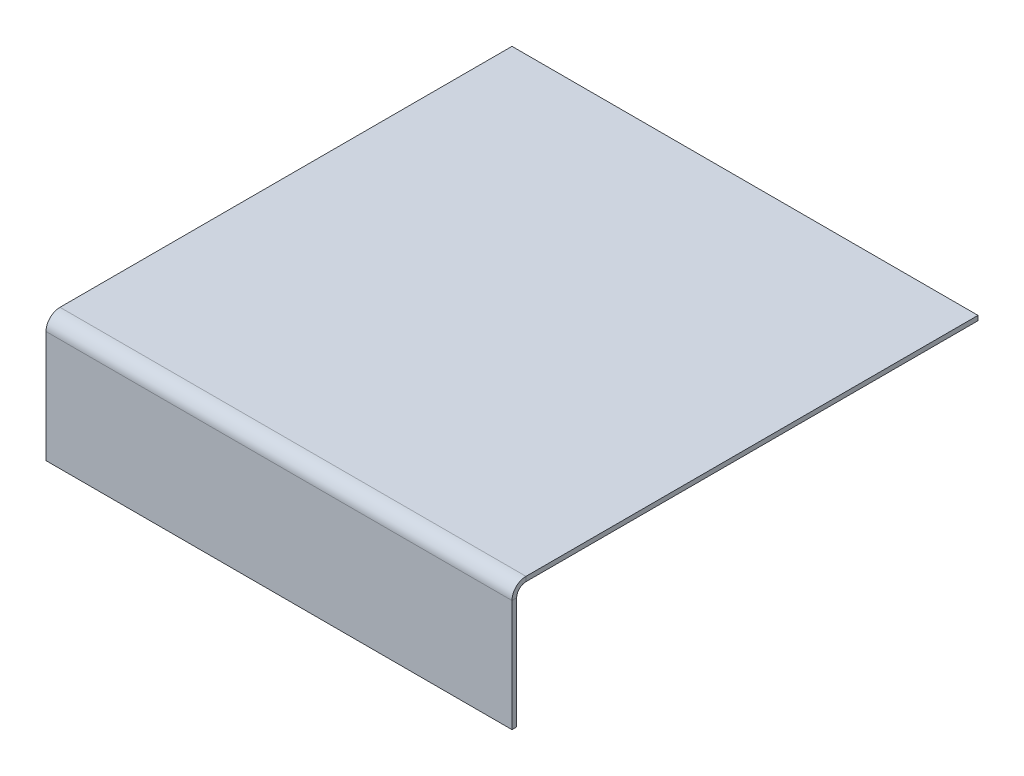
ISO-10303-21;
HEADER;
FILE_DESCRIPTION(('STEP AP214'),'2;1');
FILE_NAME('part.step','',(''),(''),'','','');
FILE_SCHEMA(('AUTOMOTIVE_DESIGN { 1 0 10303 214 1 1 1 1 }'));
ENDSEC;
DATA;
#1=APPLICATION_CONTEXT('core data for automotive mechanical design processes');
#2=APPLICATION_PROTOCOL_DEFINITION('international standard','automotive_design',2000,#1);
#3=PRODUCT_CONTEXT('',#1,'mechanical');
#4=PRODUCT('Part','Part','',(#3));
#5=PRODUCT_RELATED_PRODUCT_CATEGORY('part','',(#4));
#6=PRODUCT_DEFINITION_FORMATION('','',#4);
#7=PRODUCT_DEFINITION_CONTEXT('part definition',#1,'design');
#8=PRODUCT_DEFINITION('design','',#6,#7);
#9=PRODUCT_DEFINITION_SHAPE('','',#8);
#10=(LENGTH_UNIT() NAMED_UNIT(*) SI_UNIT(.MILLI.,.METRE.));
#11=(NAMED_UNIT(*) PLANE_ANGLE_UNIT() SI_UNIT($,.RADIAN.));
#12=(NAMED_UNIT(*) SI_UNIT($,.STERADIAN.) SOLID_ANGLE_UNIT());
#13=UNCERTAINTY_MEASURE_WITH_UNIT(LENGTH_MEASURE(1.E-05),#10,'distance_accuracy_value','');
#14=(GEOMETRIC_REPRESENTATION_CONTEXT(3) GLOBAL_UNCERTAINTY_ASSIGNED_CONTEXT((#13)) GLOBAL_UNIT_ASSIGNED_CONTEXT((#10,
#11,#12)) REPRESENTATION_CONTEXT('',''));
#15=CARTESIAN_POINT('',(0.,0.,0.));
#16=DIRECTION('',(0.,0.,1.));
#17=DIRECTION('',(1.,0.,0.));
#18=AXIS2_PLACEMENT_3D('',#15,#16,#17);
#19=CARTESIAN_POINT('',(-50.,-1.,50.));
#20=DIRECTION('',(-1.,0.,0.));
#21=DIRECTION('',(0.,0.,1.));
#22=AXIS2_PLACEMENT_3D('',#19,#20,#21);
#23=PLANE('',#22);
#24=DIRECTION('',(0.,0.,1.));
#25=VECTOR('',#24,1.);
#26=CARTESIAN_POINT('',(-50.,-1.,50.));
#27=LINE('',#26,#25);
#28=CARTESIAN_POINT('',(-50.,-1.,-50.));
#29=VERTEX_POINT('',#28);
#30=CARTESIAN_POINT('',(-50.,-1.,47.));
#31=VERTEX_POINT('',#30);
#32=EDGE_CURVE('E196',#29,#31,#27,.T.);
#33=ORIENTED_EDGE('',*,*,#32,.T.);
#34=DIRECTION('',(0.,1.,0.));
#35=VECTOR('',#34,1.);
#36=CARTESIAN_POINT('',(-50.,-0.999999999999994,47.));
#37=LINE('',#36,#35);
#38=CARTESIAN_POINT('',(-50.,0.,47.));
#39=VERTEX_POINT('',#38);
#40=EDGE_CURVE('E181',#31,#39,#37,.T.);
#41=ORIENTED_EDGE('',*,*,#40,.T.);
#42=DIRECTION('',(0.,0.,1.));
#43=VECTOR('',#42,1.);
#44=CARTESIAN_POINT('',(-50.,0.,50.));
#45=LINE('',#44,#43);
#46=CARTESIAN_POINT('',(-50.,0.,-50.));
#47=VERTEX_POINT('',#46);
#48=EDGE_CURVE('E193',#47,#39,#45,.T.);
#49=ORIENTED_EDGE('',*,*,#48,.F.);
#50=DIRECTION('',(0.,1.,0.));
#51=VECTOR('',#50,1.);
#52=CARTESIAN_POINT('',(-50.,-1.,-50.));
#53=LINE('',#52,#51);
#54=EDGE_CURVE('E13',#29,#47,#53,.T.);
#55=ORIENTED_EDGE('',*,*,#54,.F.);
#56=EDGE_LOOP('',(#33,#41,#49,#55));
#57=FACE_BOUND('',#56,.T.);
#58=ADVANCED_FACE('F58',(#57),#23,.T.);
#59=CARTESIAN_POINT('',(0.,-1.,0.));
#60=DIRECTION('',(0.,-1.,0.));
#61=DIRECTION('',(0.,0.,-1.));
#62=AXIS2_PLACEMENT_3D('',#59,#60,#61);
#63=PLANE('',#62);
#64=DIRECTION('',(0.,0.,-1.));
#65=VECTOR('',#64,1.);
#66=CARTESIAN_POINT('',(50.,-1.,50.));
#67=LINE('',#66,#65);
#68=CARTESIAN_POINT('',(50.,-1.,47.));
#69=VERTEX_POINT('',#68);
#70=CARTESIAN_POINT('',(50.,-1.,-50.));
#71=VERTEX_POINT('',#70);
#72=EDGE_CURVE('E190',#69,#71,#67,.T.);
#73=ORIENTED_EDGE('',*,*,#72,.F.);
#74=DIRECTION('',(-1.,0.,0.));
#75=VECTOR('',#74,1.);
#76=CARTESIAN_POINT('',(-50.,-0.999999999999994,47.));
#77=LINE('',#76,#75);
#78=EDGE_CURVE('E73',#31,#69,#77,.F.);
#79=ORIENTED_EDGE('',*,*,#78,.F.);
#80=ORIENTED_EDGE('',*,*,#32,.F.);
#81=DIRECTION('',(-1.,0.,0.));
#82=VECTOR('',#81,1.);
#83=CARTESIAN_POINT('',(-50.,-1.,-50.));
#84=LINE('',#83,#82);
#85=EDGE_CURVE('E192',#71,#29,#84,.T.);
#86=ORIENTED_EDGE('',*,*,#85,.F.);
#87=EDGE_LOOP('',(#73,#79,#80,#86));
#88=FACE_BOUND('',#87,.T.);
#89=ADVANCED_FACE('F230',(#88),#63,.T.);
#90=CARTESIAN_POINT('',(0.,0.,0.));
#91=DIRECTION('',(0.,-1.,0.));
#92=DIRECTION('',(0.,0.,-1.));
#93=AXIS2_PLACEMENT_3D('',#90,#91,#92);
#94=PLANE('',#93);
#95=DIRECTION('',(-1.,0.,0.));
#96=VECTOR('',#95,1.);
#97=CARTESIAN_POINT('',(-50.,0.,47.));
#98=LINE('',#97,#96);
#99=CARTESIAN_POINT('',(50.,0.,47.));
#100=VERTEX_POINT('',#99);
#101=EDGE_CURVE('E131',#39,#100,#98,.F.);
#102=ORIENTED_EDGE('',*,*,#101,.T.);
#103=DIRECTION('',(0.,0.,-1.));
#104=VECTOR('',#103,1.);
#105=CARTESIAN_POINT('',(50.,0.,50.));
#106=LINE('',#105,#104);
#107=CARTESIAN_POINT('',(50.,0.,-50.));
#108=VERTEX_POINT('',#107);
#109=EDGE_CURVE('E188',#100,#108,#106,.T.);
#110=ORIENTED_EDGE('',*,*,#109,.T.);
#111=DIRECTION('',(-1.,0.,0.));
#112=VECTOR('',#111,1.);
#113=CARTESIAN_POINT('',(-50.,0.,-50.));
#114=LINE('',#113,#112);
#115=EDGE_CURVE('E199',#108,#47,#114,.T.);
#116=ORIENTED_EDGE('',*,*,#115,.T.);
#117=ORIENTED_EDGE('',*,*,#48,.T.);
#118=EDGE_LOOP('',(#102,#110,#116,#117));
#119=FACE_BOUND('',#118,.T.);
#120=ADVANCED_FACE('F205',(#119),#94,.F.);
#121=CARTESIAN_POINT('',(50.,-1.,50.));
#122=DIRECTION('',(1.,0.,0.));
#123=DIRECTION('',(0.,0.,-1.));
#124=AXIS2_PLACEMENT_3D('',#121,#122,#123);
#125=PLANE('',#124);
#126=DIRECTION('',(0.,1.,0.));
#127=VECTOR('',#126,1.);
#128=CARTESIAN_POINT('',(50.,-0.999999999999994,47.));
#129=LINE('',#128,#127);
#130=EDGE_CURVE('E81',#69,#100,#129,.T.);
#131=ORIENTED_EDGE('',*,*,#130,.F.);
#132=ORIENTED_EDGE('',*,*,#72,.T.);
#133=DIRECTION('',(0.,1.,0.));
#134=VECTOR('',#133,1.);
#135=CARTESIAN_POINT('',(50.,-1.,-50.));
#136=LINE('',#135,#134);
#137=EDGE_CURVE('E62',#71,#108,#136,.T.);
#138=ORIENTED_EDGE('',*,*,#137,.T.);
#139=ORIENTED_EDGE('',*,*,#109,.F.);
#140=EDGE_LOOP('',(#131,#132,#138,#139));
#141=FACE_BOUND('',#140,.T.);
#142=ADVANCED_FACE('F60',(#141),#125,.T.);
#143=CARTESIAN_POINT('',(-50.,-1.,-50.));
#144=DIRECTION('',(0.,0.,-1.));
#145=DIRECTION('',(-1.,0.,0.));
#146=AXIS2_PLACEMENT_3D('',#143,#144,#145);
#147=PLANE('',#146);
#148=ORIENTED_EDGE('',*,*,#115,.F.);
#149=ORIENTED_EDGE('',*,*,#137,.F.);
#150=ORIENTED_EDGE('',*,*,#85,.T.);
#151=ORIENTED_EDGE('',*,*,#54,.T.);
#152=EDGE_LOOP('',(#148,#149,#150,#151));
#153=FACE_BOUND('',#152,.T.);
#154=ADVANCED_FACE('F237',(#153),#147,.T.);
#155=CARTESIAN_POINT('',(50.,-3.,47.));
#156=DIRECTION('',(1.,0.,0.));
#157=DIRECTION('',(0.,0.,-1.));
#158=AXIS2_PLACEMENT_3D('',#155,#156,#157);
#159=PLANE('',#158);
#160=DIRECTION('',(0.,0.,1.));
#161=VECTOR('',#160,1.);
#162=CARTESIAN_POINT('',(50.,-3.,50.0000000000001));
#163=LINE('',#162,#161);
#164=CARTESIAN_POINT('',(50.,-2.99999999999999,49.));
#165=VERTEX_POINT('',#164);
#166=CARTESIAN_POINT('',(50.,-2.99999999999999,50.));
#167=VERTEX_POINT('',#166);
#168=EDGE_CURVE('E176',#165,#167,#163,.T.);
#169=ORIENTED_EDGE('',*,*,#168,.F.);
#170=CARTESIAN_POINT('',(50.,-3.,47.));
#171=DIRECTION('',(-1.,0.,0.));
#172=DIRECTION('',(0.,0.,1.));
#173=AXIS2_PLACEMENT_3D('',#170,#171,#172);
#174=CIRCLE('',#173,2.);
#175=EDGE_CURVE('E134',#69,#165,#174,.F.);
#176=ORIENTED_EDGE('',*,*,#175,.F.);
#177=ORIENTED_EDGE('',*,*,#130,.T.);
#178=CARTESIAN_POINT('',(50.,-3.,47.));
#179=DIRECTION('',(-1.,0.,0.));
#180=DIRECTION('',(0.,0.,1.));
#181=AXIS2_PLACEMENT_3D('',#178,#179,#180);
#182=CIRCLE('',#181,3.);
#183=EDGE_CURVE('E180',#100,#167,#182,.F.);
#184=ORIENTED_EDGE('',*,*,#183,.T.);
#185=EDGE_LOOP('',(#169,#176,#177,#184));
#186=FACE_BOUND('',#185,.T.);
#187=ADVANCED_FACE('F239',(#186),#159,.T.);
#188=CARTESIAN_POINT('',(-50.,-3.,47.));
#189=DIRECTION('',(1.,0.,0.));
#190=DIRECTION('',(0.,0.,-1.));
#191=AXIS2_PLACEMENT_3D('',#188,#189,#190);
#192=PLANE('',#191);
#193=CARTESIAN_POINT('',(-50.,-3.,47.));
#194=DIRECTION('',(-1.,0.,0.));
#195=DIRECTION('',(0.,0.,1.));
#196=AXIS2_PLACEMENT_3D('',#193,#194,#195);
#197=CIRCLE('',#196,2.);
#198=CARTESIAN_POINT('',(-50.,-2.99999999999999,49.));
#199=VERTEX_POINT('',#198);
#200=EDGE_CURVE('E141',#199,#31,#197,.T.);
#201=ORIENTED_EDGE('',*,*,#200,.F.);
#202=DIRECTION('',(0.,0.,1.));
#203=VECTOR('',#202,1.);
#204=CARTESIAN_POINT('',(-50.,-3.,49.));
#205=LINE('',#204,#203);
#206=CARTESIAN_POINT('',(-50.,-3.,50.));
#207=VERTEX_POINT('',#206);
#208=EDGE_CURVE('E138',#199,#207,#205,.T.);
#209=ORIENTED_EDGE('',*,*,#208,.T.);
#210=CARTESIAN_POINT('',(-50.,-3.,47.));
#211=DIRECTION('',(-1.,0.,0.));
#212=DIRECTION('',(0.,0.,1.));
#213=AXIS2_PLACEMENT_3D('',#210,#211,#212);
#214=CIRCLE('',#213,3.);
#215=EDGE_CURVE('E124',#207,#39,#214,.T.);
#216=ORIENTED_EDGE('',*,*,#215,.T.);
#217=ORIENTED_EDGE('',*,*,#40,.F.);
#218=EDGE_LOOP('',(#201,#209,#216,#217));
#219=FACE_BOUND('',#218,.T.);
#220=ADVANCED_FACE('F139',(#219),#192,.F.);
#221=CARTESIAN_POINT('',(-50.,-3.,47.));
#222=DIRECTION('',(-1.,0.,0.));
#223=DIRECTION('',(0.,0.,1.));
#224=AXIS2_PLACEMENT_3D('',#221,#222,#223);
#225=CYLINDRICAL_SURFACE('',#224,3.);
#226=ORIENTED_EDGE('',*,*,#101,.F.);
#227=ORIENTED_EDGE('',*,*,#215,.F.);
#228=DIRECTION('',(-1.,0.,0.));
#229=VECTOR('',#228,1.);
#230=CARTESIAN_POINT('',(0.,-3.,50.));
#231=LINE('',#230,#229);
#232=EDGE_CURVE('E129',#167,#207,#231,.T.);
#233=ORIENTED_EDGE('',*,*,#232,.F.);
#234=ORIENTED_EDGE('',*,*,#183,.F.);
#235=EDGE_LOOP('',(#226,#227,#233,#234));
#236=FACE_BOUND('',#235,.T.);
#237=ADVANCED_FACE('F126',(#236),#225,.T.);
#238=CARTESIAN_POINT('',(-50.,-3.,47.));
#239=DIRECTION('',(-1.,0.,0.));
#240=DIRECTION('',(0.,0.,1.));
#241=AXIS2_PLACEMENT_3D('',#238,#239,#240);
#242=CYLINDRICAL_SURFACE('',#241,2.);
#243=ORIENTED_EDGE('',*,*,#78,.T.);
#244=ORIENTED_EDGE('',*,*,#175,.T.);
#245=DIRECTION('',(1.,0.,0.));
#246=VECTOR('',#245,1.);
#247=CARTESIAN_POINT('',(50.,-3.,49.));
#248=LINE('',#247,#246);
#249=EDGE_CURVE('E146',#165,#199,#248,.F.);
#250=ORIENTED_EDGE('',*,*,#249,.T.);
#251=ORIENTED_EDGE('',*,*,#200,.T.);
#252=EDGE_LOOP('',(#243,#244,#250,#251));
#253=FACE_BOUND('',#252,.T.);
#254=ADVANCED_FACE('F209',(#253),#242,.F.);
#255=CARTESIAN_POINT('',(-50.,-0.999999999999997,50.));
#256=DIRECTION('',(-1.,0.,0.));
#257=DIRECTION('',(0.,-1.,0.));
#258=AXIS2_PLACEMENT_3D('',#255,#256,#257);
#259=PLANE('',#258);
#260=DIRECTION('',(0.,1.,0.));
#261=VECTOR('',#260,1.);
#262=CARTESIAN_POINT('',(-50.,-0.999999999999997,50.));
#263=LINE('',#262,#261);
#264=CARTESIAN_POINT('',(-50.,-27.,50.0000000000001));
#265=VERTEX_POINT('',#264);
#266=EDGE_CURVE('E153',#265,#207,#263,.T.);
#267=ORIENTED_EDGE('',*,*,#266,.T.);
#268=ORIENTED_EDGE('',*,*,#208,.F.);
#269=DIRECTION('',(0.,-1.,0.));
#270=VECTOR('',#269,1.);
#271=CARTESIAN_POINT('',(-50.,1.46784294121114E-13,49.));
#272=LINE('',#271,#270);
#273=CARTESIAN_POINT('',(-50.,-27.,49.0000000000001));
#274=VERTEX_POINT('',#273);
#275=EDGE_CURVE('E169',#274,#199,#272,.F.);
#276=ORIENTED_EDGE('',*,*,#275,.F.);
#277=DIRECTION('',(0.,0.,-1.));
#278=VECTOR('',#277,1.);
#279=CARTESIAN_POINT('',(-50.,-27.,50.0000000000001));
#280=LINE('',#279,#278);
#281=EDGE_CURVE('E158',#265,#274,#280,.T.);
#282=ORIENTED_EDGE('',*,*,#281,.F.);
#283=EDGE_LOOP('',(#267,#268,#276,#282));
#284=FACE_BOUND('',#283,.T.);
#285=ADVANCED_FACE('F157',(#284),#259,.T.);
#286=CARTESIAN_POINT('',(50.,-27.,50.0000000000001));
#287=DIRECTION('',(1.,0.,0.));
#288=DIRECTION('',(0.,1.,0.));
#289=AXIS2_PLACEMENT_3D('',#286,#287,#288);
#290=PLANE('',#289);
#291=DIRECTION('',(0.,1.,0.));
#292=VECTOR('',#291,1.);
#293=CARTESIAN_POINT('',(50.,2.00160401074247E-13,49.));
#294=LINE('',#293,#292);
#295=CARTESIAN_POINT('',(50.,-27.,49.0000000000001));
#296=VERTEX_POINT('',#295);
#297=EDGE_CURVE('E155',#165,#296,#294,.F.);
#298=ORIENTED_EDGE('',*,*,#297,.F.);
#299=ORIENTED_EDGE('',*,*,#168,.T.);
#300=DIRECTION('',(0.,-1.,0.));
#301=VECTOR('',#300,1.);
#302=CARTESIAN_POINT('',(50.,-27.,50.0000000000001));
#303=LINE('',#302,#301);
#304=CARTESIAN_POINT('',(50.,-27.,50.0000000000001));
#305=VERTEX_POINT('',#304);
#306=EDGE_CURVE('E154',#167,#305,#303,.T.);
#307=ORIENTED_EDGE('',*,*,#306,.T.);
#308=DIRECTION('',(0.,0.,-1.));
#309=VECTOR('',#308,1.);
#310=CARTESIAN_POINT('',(50.,-27.,50.0000000000001));
#311=LINE('',#310,#309);
#312=EDGE_CURVE('E160',#305,#296,#311,.T.);
#313=ORIENTED_EDGE('',*,*,#312,.T.);
#314=EDGE_LOOP('',(#298,#299,#307,#313));
#315=FACE_BOUND('',#314,.T.);
#316=ADVANCED_FACE('F216',(#315),#290,.T.);
#317=CARTESIAN_POINT('',(0.,1.76963828936524E-13,50.));
#318=DIRECTION('',(0.,0.,1.));
#319=DIRECTION('',(0.,-1.,0.));
#320=AXIS2_PLACEMENT_3D('',#317,#318,#319);
#321=PLANE('',#320);
#322=ORIENTED_EDGE('',*,*,#306,.F.);
#323=ORIENTED_EDGE('',*,*,#232,.T.);
#324=ORIENTED_EDGE('',*,*,#266,.F.);
#325=DIRECTION('',(-1.,0.,0.));
#326=VECTOR('',#325,1.);
#327=CARTESIAN_POINT('',(-50.,-27.,50.0000000000001));
#328=LINE('',#327,#326);
#329=EDGE_CURVE('E161',#305,#265,#328,.T.);
#330=ORIENTED_EDGE('',*,*,#329,.F.);
#331=EDGE_LOOP('',(#322,#323,#324,#330));
#332=FACE_BOUND('',#331,.T.);
#333=ADVANCED_FACE('F151',(#332),#321,.T.);
#334=CARTESIAN_POINT('',(0.,1.73472347597681E-13,49.));
#335=DIRECTION('',(0.,0.,1.));
#336=DIRECTION('',(0.,-1.,0.));
#337=AXIS2_PLACEMENT_3D('',#334,#335,#336);
#338=PLANE('',#337);
#339=ORIENTED_EDGE('',*,*,#249,.F.);
#340=ORIENTED_EDGE('',*,*,#297,.T.);
#341=DIRECTION('',(1.,0.,0.));
#342=VECTOR('',#341,1.);
#343=CARTESIAN_POINT('',(0.,-27.,49.0000000000001));
#344=LINE('',#343,#342);
#345=EDGE_CURVE('E171',#296,#274,#344,.F.);
#346=ORIENTED_EDGE('',*,*,#345,.T.);
#347=ORIENTED_EDGE('',*,*,#275,.T.);
#348=EDGE_LOOP('',(#339,#340,#346,#347));
#349=FACE_BOUND('',#348,.T.);
#350=ADVANCED_FACE('F214',(#349),#338,.F.);
#351=CARTESIAN_POINT('',(-50.,-27.,50.0000000000001));
#352=DIRECTION('',(0.,-1.,0.));
#353=DIRECTION('',(0.,0.,-1.));
#354=AXIS2_PLACEMENT_3D('',#351,#352,#353);
#355=PLANE('',#354);
#356=ORIENTED_EDGE('',*,*,#345,.F.);
#357=ORIENTED_EDGE('',*,*,#312,.F.);
#358=ORIENTED_EDGE('',*,*,#329,.T.);
#359=ORIENTED_EDGE('',*,*,#281,.T.);
#360=EDGE_LOOP('',(#356,#357,#358,#359));
#361=FACE_BOUND('',#360,.T.);
#362=ADVANCED_FACE('F220',(#361),#355,.T.);
#363=CLOSED_SHELL('',(#58,#89,#120,#142,#154,#187,#220,#237,#254,#285,#316,#333,#350,#362));
#364=MANIFOLD_SOLID_BREP('B2',#363);
#365=ADVANCED_BREP_SHAPE_REPRESENTATION('',(#18,#364),#14);
#366=SHAPE_DEFINITION_REPRESENTATION(#9,#365);
ENDSEC;
END-ISO-10303-21;
